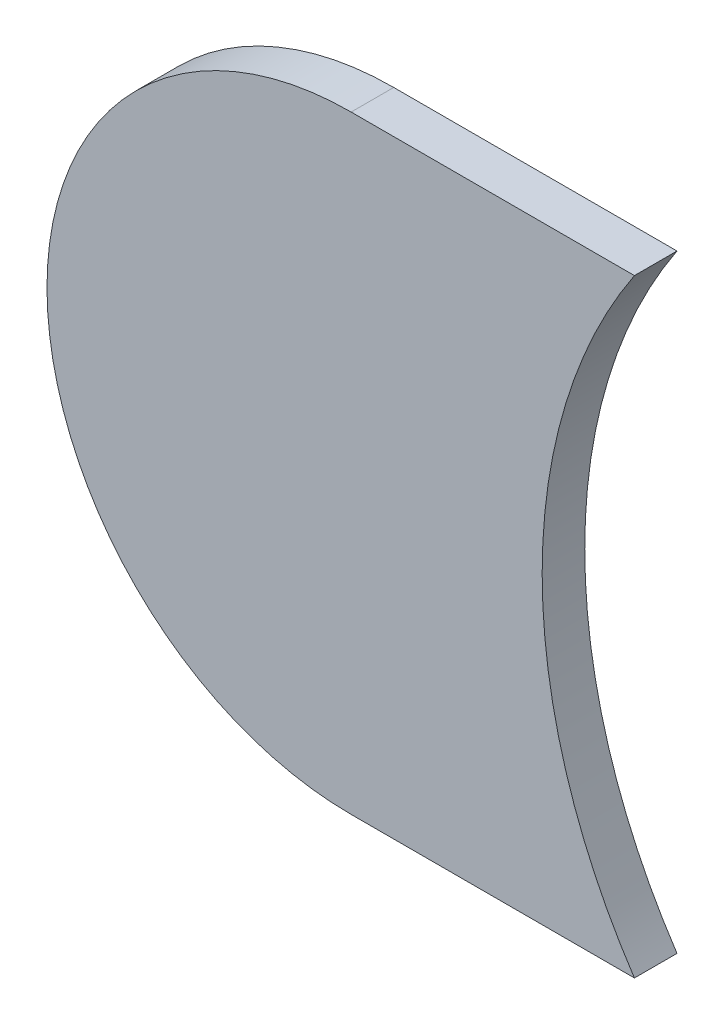
ISO-10303-21;
HEADER;
FILE_DESCRIPTION(('STEP AP214'),'2;1');
FILE_NAME('part.step','',(''),(''),'','','');
FILE_SCHEMA(('AUTOMOTIVE_DESIGN { 1 0 10303 214 1 1 1 1 }'));
ENDSEC;
DATA;
#1=APPLICATION_CONTEXT('core data for automotive mechanical design processes');
#2=APPLICATION_PROTOCOL_DEFINITION('international standard','automotive_design',2000,#1);
#3=PRODUCT_CONTEXT('',#1,'mechanical');
#4=PRODUCT('Part','Part','',(#3));
#5=PRODUCT_RELATED_PRODUCT_CATEGORY('part','',(#4));
#6=PRODUCT_DEFINITION_FORMATION('','',#4);
#7=PRODUCT_DEFINITION_CONTEXT('part definition',#1,'design');
#8=PRODUCT_DEFINITION('design','',#6,#7);
#9=PRODUCT_DEFINITION_SHAPE('','',#8);
#10=(LENGTH_UNIT() NAMED_UNIT(*) SI_UNIT(.MILLI.,.METRE.));
#11=(NAMED_UNIT(*) PLANE_ANGLE_UNIT() SI_UNIT($,.RADIAN.));
#12=(NAMED_UNIT(*) SI_UNIT($,.STERADIAN.) SOLID_ANGLE_UNIT());
#13=UNCERTAINTY_MEASURE_WITH_UNIT(LENGTH_MEASURE(1.E-05),#10,'distance_accuracy_value','');
#14=(GEOMETRIC_REPRESENTATION_CONTEXT(3) GLOBAL_UNCERTAINTY_ASSIGNED_CONTEXT((#13)) GLOBAL_UNIT_ASSIGNED_CONTEXT((#10,
#11,#12)) REPRESENTATION_CONTEXT('',''));
#15=CARTESIAN_POINT('',(0.,0.,0.));
#16=DIRECTION('',(0.,0.,1.));
#17=DIRECTION('',(1.,0.,0.));
#18=AXIS2_PLACEMENT_3D('',#15,#16,#17);
#19=CARTESIAN_POINT('',(177.26,-124.206,-0.035));
#20=DIRECTION('',(0.,-1.,0.));
#21=DIRECTION('',(0.,0.,-1.));
#22=AXIS2_PLACEMENT_3D('',#19,#20,#21);
#23=PLANE('',#22);
#24=DIRECTION('',(0.,0.,1.));
#25=VECTOR('',#24,1.);
#26=CARTESIAN_POINT('',(176.653,-124.206,-0.035));
#27=LINE('',#26,#25);
#28=CARTESIAN_POINT('',(176.653,-124.206,-0.035));
#29=VERTEX_POINT('',#28);
#30=CARTESIAN_POINT('',(176.653,-124.206,0.));
#31=VERTEX_POINT('',#30);
#32=EDGE_CURVE('E11',#29,#31,#27,.T.);
#33=ORIENTED_EDGE('',*,*,#32,.T.);
#34=DIRECTION('',(-1.,0.,0.));
#35=VECTOR('',#34,1.);
#36=CARTESIAN_POINT('',(177.26,-124.206,0.));
#37=LINE('',#36,#35);
#38=CARTESIAN_POINT('',(176.88583426132,-124.206,0.));
#39=VERTEX_POINT('',#38);
#40=EDGE_CURVE('E27',#39,#31,#37,.T.);
#41=ORIENTED_EDGE('',*,*,#40,.F.);
#42=DIRECTION('',(0.,0.,-1.));
#43=VECTOR('',#42,1.);
#44=CARTESIAN_POINT('',(176.88583426132,-124.206,-0.045));
#45=LINE('',#44,#43);
#46=CARTESIAN_POINT('',(176.88583426132,-124.206,-0.035));
#47=VERTEX_POINT('',#46);
#48=EDGE_CURVE('E54',#39,#47,#45,.T.);
#49=ORIENTED_EDGE('',*,*,#48,.T.);
#50=DIRECTION('',(-1.,0.,0.));
#51=VECTOR('',#50,1.);
#52=CARTESIAN_POINT('',(177.26,-124.206,-0.035));
#53=LINE('',#52,#51);
#54=EDGE_CURVE('E57',#47,#29,#53,.T.);
#55=ORIENTED_EDGE('',*,*,#54,.T.);
#56=EDGE_LOOP('',(#33,#41,#49,#55));
#57=FACE_BOUND('',#56,.T.);
#58=ADVANCED_FACE('F17',(#57),#23,.F.);
#59=CARTESIAN_POINT('',(176.653,-124.456,-0.035));
#60=DIRECTION('',(0.,0.,-1.));
#61=DIRECTION('',(0.,1.,0.));
#62=AXIS2_PLACEMENT_3D('',#59,#60,#61);
#63=CYLINDRICAL_SURFACE('',#62,0.25);
#64=CARTESIAN_POINT('',(176.653,-124.456,-0.035));
#65=DIRECTION('',(0.,0.,1.));
#66=DIRECTION('',(0.,1.,0.));
#67=AXIS2_PLACEMENT_3D('',#64,#65,#66);
#68=CIRCLE('',#67,0.25);
#69=CARTESIAN_POINT('',(176.653,-124.706,-0.035));
#70=VERTEX_POINT('',#69);
#71=EDGE_CURVE('E76',#29,#70,#68,.T.);
#72=ORIENTED_EDGE('',*,*,#71,.T.);
#73=DIRECTION('',(0.,0.,1.));
#74=VECTOR('',#73,1.);
#75=CARTESIAN_POINT('',(176.653,-124.706,-0.035));
#76=LINE('',#75,#74);
#77=CARTESIAN_POINT('',(176.653,-124.706,0.));
#78=VERTEX_POINT('',#77);
#79=EDGE_CURVE('E87',#70,#78,#76,.T.);
#80=ORIENTED_EDGE('',*,*,#79,.T.);
#81=CARTESIAN_POINT('',(176.653,-124.456,0.));
#82=DIRECTION('',(0.,0.,1.));
#83=DIRECTION('',(0.,1.,0.));
#84=AXIS2_PLACEMENT_3D('',#81,#82,#83);
#85=CIRCLE('',#84,0.25);
#86=EDGE_CURVE('E62',#31,#78,#85,.T.);
#87=ORIENTED_EDGE('',*,*,#86,.F.);
#88=ORIENTED_EDGE('',*,*,#32,.F.);
#89=EDGE_LOOP('',(#72,#80,#87,#88));
#90=FACE_BOUND('',#89,.T.);
#91=ADVANCED_FACE('F19',(#90),#63,.T.);
#92=CARTESIAN_POINT('',(176.653,-124.706,0.));
#93=DIRECTION('',(0.,0.,1.));
#94=DIRECTION('',(1.,0.,0.));
#95=AXIS2_PLACEMENT_3D('',#92,#93,#94);
#96=PLANE('',#95);
#97=ORIENTED_EDGE('',*,*,#86,.T.);
#98=DIRECTION('',(1.,0.,0.));
#99=VECTOR('',#98,1.);
#100=CARTESIAN_POINT('',(176.653,-124.706,0.));
#101=LINE('',#100,#99);
#102=CARTESIAN_POINT('',(176.88583426132,-124.706,0.));
#103=VERTEX_POINT('',#102);
#104=EDGE_CURVE('E90',#78,#103,#101,.T.);
#105=ORIENTED_EDGE('',*,*,#104,.T.);
#106=CARTESIAN_POINT('',(177.26,-124.456,0.));
#107=DIRECTION('',(0.,0.,-1.));
#108=DIRECTION('',(0.,-1.,0.));
#109=AXIS2_PLACEMENT_3D('',#106,#107,#108);
#110=CIRCLE('',#109,0.45);
#111=EDGE_CURVE('E63',#103,#39,#110,.T.);
#112=ORIENTED_EDGE('',*,*,#111,.T.);
#113=ORIENTED_EDGE('',*,*,#40,.T.);
#114=EDGE_LOOP('',(#97,#105,#112,#113));
#115=FACE_BOUND('',#114,.T.);
#116=ADVANCED_FACE('F170',(#115),#96,.T.);
#117=CARTESIAN_POINT('',(177.26,-124.456,-0.045));
#118=DIRECTION('',(0.,0.,-1.));
#119=DIRECTION('',(0.,-1.,0.));
#120=AXIS2_PLACEMENT_3D('',#117,#118,#119);
#121=CYLINDRICAL_SURFACE('',#120,0.45);
#122=ORIENTED_EDGE('',*,*,#111,.F.);
#123=DIRECTION('',(0.,0.,-1.));
#124=VECTOR('',#123,1.);
#125=CARTESIAN_POINT('',(176.88583426132,-124.706,-0.045));
#126=LINE('',#125,#124);
#127=CARTESIAN_POINT('',(176.88583426132,-124.706,-0.035));
#128=VERTEX_POINT('',#127);
#129=EDGE_CURVE('E71',#103,#128,#126,.T.);
#130=ORIENTED_EDGE('',*,*,#129,.T.);
#131=CARTESIAN_POINT('',(177.26,-124.456,-0.035));
#132=DIRECTION('',(0.,0.,-1.));
#133=DIRECTION('',(0.,-1.,0.));
#134=AXIS2_PLACEMENT_3D('',#131,#132,#133);
#135=CIRCLE('',#134,0.45);
#136=EDGE_CURVE('E67',#128,#47,#135,.T.);
#137=ORIENTED_EDGE('',*,*,#136,.T.);
#138=ORIENTED_EDGE('',*,*,#48,.F.);
#139=EDGE_LOOP('',(#122,#130,#137,#138));
#140=FACE_BOUND('',#139,.T.);
#141=ADVANCED_FACE('F68',(#140),#121,.F.);
#142=CARTESIAN_POINT('',(176.653,-124.706,-0.035));
#143=DIRECTION('',(0.,0.,1.));
#144=DIRECTION('',(1.,0.,0.));
#145=AXIS2_PLACEMENT_3D('',#142,#143,#144);
#146=PLANE('',#145);
#147=ORIENTED_EDGE('',*,*,#54,.F.);
#148=ORIENTED_EDGE('',*,*,#136,.F.);
#149=DIRECTION('',(1.,0.,0.));
#150=VECTOR('',#149,1.);
#151=CARTESIAN_POINT('',(176.653,-124.706,-0.035));
#152=LINE('',#151,#150);
#153=EDGE_CURVE('E81',#70,#128,#152,.T.);
#154=ORIENTED_EDGE('',*,*,#153,.F.);
#155=ORIENTED_EDGE('',*,*,#71,.F.);
#156=EDGE_LOOP('',(#147,#148,#154,#155));
#157=FACE_BOUND('',#156,.T.);
#158=ADVANCED_FACE('F79',(#157),#146,.F.);
#159=CARTESIAN_POINT('',(176.653,-124.706,-0.035));
#160=DIRECTION('',(0.,1.,0.));
#161=DIRECTION('',(1.,0.,0.));
#162=AXIS2_PLACEMENT_3D('',#159,#160,#161);
#163=PLANE('',#162);
#164=ORIENTED_EDGE('',*,*,#129,.F.);
#165=ORIENTED_EDGE('',*,*,#104,.F.);
#166=ORIENTED_EDGE('',*,*,#79,.F.);
#167=ORIENTED_EDGE('',*,*,#153,.T.);
#168=EDGE_LOOP('',(#164,#165,#166,#167));
#169=FACE_BOUND('',#168,.T.);
#170=ADVANCED_FACE('F117',(#169),#163,.F.);
#171=CLOSED_SHELL('',(#58,#91,#116,#141,#158,#170));
#172=MANIFOLD_SOLID_BREP('B1',#171);
#173=ADVANCED_BREP_SHAPE_REPRESENTATION('',(#18,#172),#14);
#174=SHAPE_DEFINITION_REPRESENTATION(#9,#173);
ENDSEC;
END-ISO-10303-21;
